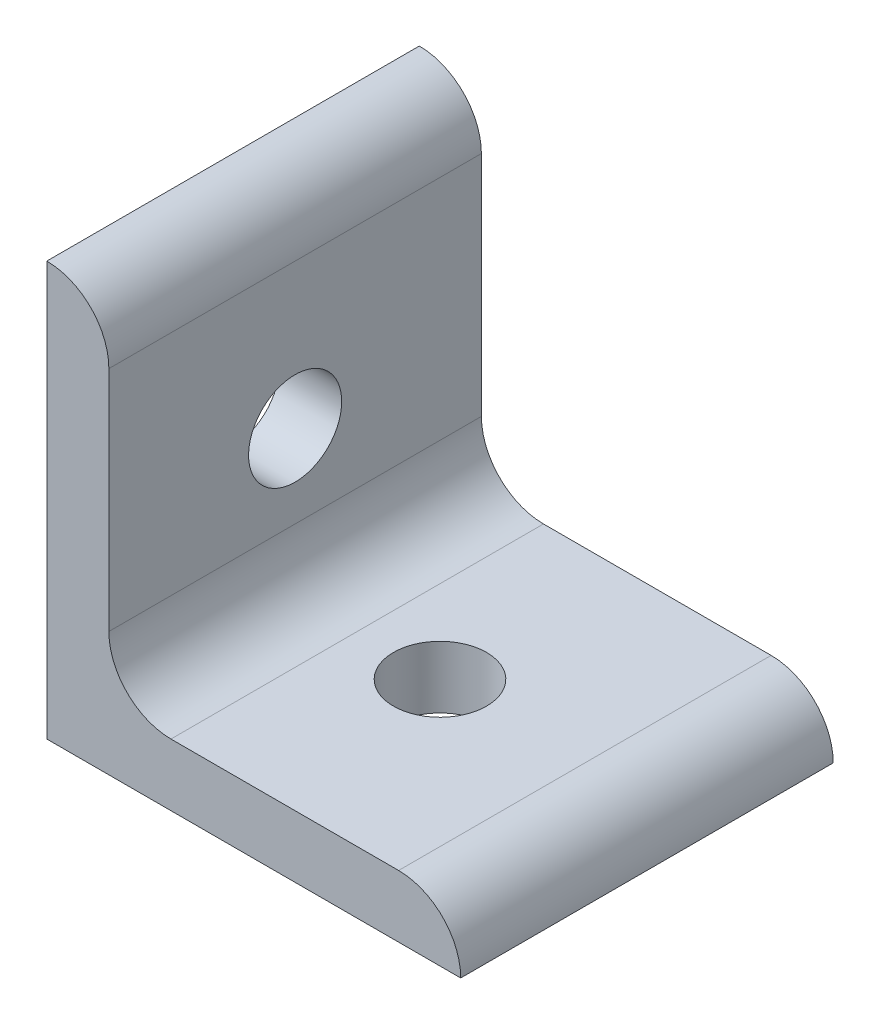
ISO-10303-21;
HEADER;
FILE_DESCRIPTION(('STEP AP214'),'2;1');
FILE_NAME('part.step','',(''),(''),'','','');
FILE_SCHEMA(('AUTOMOTIVE_DESIGN { 1 0 10303 214 1 1 1 1 }'));
ENDSEC;
DATA;
#1=APPLICATION_CONTEXT('core data for automotive mechanical design processes');
#2=APPLICATION_PROTOCOL_DEFINITION('international standard','automotive_design',2000,#1);
#3=PRODUCT_CONTEXT('',#1,'mechanical');
#4=PRODUCT('Part','Part','',(#3));
#5=PRODUCT_RELATED_PRODUCT_CATEGORY('part','',(#4));
#6=PRODUCT_DEFINITION_FORMATION('','',#4);
#7=PRODUCT_DEFINITION_CONTEXT('part definition',#1,'design');
#8=PRODUCT_DEFINITION('design','',#6,#7);
#9=PRODUCT_DEFINITION_SHAPE('','',#8);
#10=(LENGTH_UNIT() NAMED_UNIT(*) SI_UNIT(.MILLI.,.METRE.));
#11=(NAMED_UNIT(*) PLANE_ANGLE_UNIT() SI_UNIT($,.RADIAN.));
#12=(NAMED_UNIT(*) SI_UNIT($,.STERADIAN.) SOLID_ANGLE_UNIT());
#13=UNCERTAINTY_MEASURE_WITH_UNIT(LENGTH_MEASURE(1.E-05),#10,'distance_accuracy_value','');
#14=(GEOMETRIC_REPRESENTATION_CONTEXT(3) GLOBAL_UNCERTAINTY_ASSIGNED_CONTEXT((#13)) GLOBAL_UNIT_ASSIGNED_CONTEXT((#10,
#11,#12)) REPRESENTATION_CONTEXT('',''));
#15=CARTESIAN_POINT('',(0.,0.,0.));
#16=DIRECTION('',(0.,0.,1.));
#17=DIRECTION('',(1.,0.,0.));
#18=AXIS2_PLACEMENT_3D('',#15,#16,#17);
#19=CARTESIAN_POINT('',(6.,34.,18.));
#20=DIRECTION('',(-1.,0.,0.));
#21=DIRECTION('',(0.,-1.,0.));
#22=AXIS2_PLACEMENT_3D('',#19,#20,#21);
#23=PLANE('',#22);
#24=DIRECTION('',(0.,1.,0.));
#25=VECTOR('',#24,1.);
#26=CARTESIAN_POINT('',(6.,34.,-18.));
#27=LINE('',#26,#25);
#28=CARTESIAN_POINT('',(6.,12.,-18.));
#29=VERTEX_POINT('',#28);
#30=CARTESIAN_POINT('',(6.,34.,-18.));
#31=VERTEX_POINT('',#30);
#32=EDGE_CURVE('E119',#29,#31,#27,.T.);
#33=ORIENTED_EDGE('',*,*,#32,.T.);
#34=DIRECTION('',(0.,0.,-1.));
#35=VECTOR('',#34,1.);
#36=CARTESIAN_POINT('',(6.,34.,18.));
#37=LINE('',#36,#35);
#38=CARTESIAN_POINT('',(6.,34.,18.));
#39=VERTEX_POINT('',#38);
#40=EDGE_CURVE('E116',#39,#31,#37,.T.);
#41=ORIENTED_EDGE('',*,*,#40,.F.);
#42=DIRECTION('',(0.,1.,0.));
#43=VECTOR('',#42,1.);
#44=CARTESIAN_POINT('',(6.,34.,18.));
#45=LINE('',#44,#43);
#46=CARTESIAN_POINT('',(6.,12.,18.));
#47=VERTEX_POINT('',#46);
#48=EDGE_CURVE('E105',#47,#39,#45,.T.);
#49=ORIENTED_EDGE('',*,*,#48,.F.);
#50=DIRECTION('',(0.,0.,-1.));
#51=VECTOR('',#50,1.);
#52=CARTESIAN_POINT('',(6.,12.,18.));
#53=LINE('',#52,#51);
#54=EDGE_CURVE('E120',#47,#29,#53,.T.);
#55=ORIENTED_EDGE('',*,*,#54,.T.);
#56=EDGE_LOOP('',(#33,#41,#49,#55));
#57=FACE_BOUND('',#56,.T.);
#58=CARTESIAN_POINT('',(6.,20.,0.));
#59=DIRECTION('',(-1.,0.,0.));
#60=DIRECTION('',(0.,-1.,0.));
#61=AXIS2_PLACEMENT_3D('',#58,#59,#60);
#62=CIRCLE('',#61,4.5);
#63=CARTESIAN_POINT('',(6.,15.5,0.));
#64=VERTEX_POINT('',#63);
#65=EDGE_CURVE('E169',#64,#64,#62,.F.);
#66=ORIENTED_EDGE('',*,*,#65,.F.);
#67=EDGE_LOOP('',(#66));
#68=FACE_BOUND('',#67,.T.);
#69=ADVANCED_FACE('F37',(#57,#68),#23,.F.);
#70=CARTESIAN_POINT('',(0.,0.,18.));
#71=DIRECTION('',(1.,0.,0.));
#72=DIRECTION('',(0.,0.,-1.));
#73=AXIS2_PLACEMENT_3D('',#70,#71,#72);
#74=PLANE('',#73);
#75=DIRECTION('',(0.,-1.,0.));
#76=VECTOR('',#75,1.);
#77=CARTESIAN_POINT('',(0.,0.,-18.));
#78=LINE('',#77,#76);
#79=CARTESIAN_POINT('',(0.,40.,-18.));
#80=VERTEX_POINT('',#79);
#81=CARTESIAN_POINT('',(0.,0.,-18.));
#82=VERTEX_POINT('',#81);
#83=EDGE_CURVE('E87',#80,#82,#78,.T.);
#84=ORIENTED_EDGE('',*,*,#83,.T.);
#85=DIRECTION('',(0.,0.,-1.));
#86=VECTOR('',#85,1.);
#87=CARTESIAN_POINT('',(0.,0.,18.));
#88=LINE('',#87,#86);
#89=CARTESIAN_POINT('',(0.,0.,18.));
#90=VERTEX_POINT('',#89);
#91=EDGE_CURVE('E125',#90,#82,#88,.T.);
#92=ORIENTED_EDGE('',*,*,#91,.F.);
#93=DIRECTION('',(0.,-1.,0.));
#94=VECTOR('',#93,1.);
#95=CARTESIAN_POINT('',(0.,0.,18.));
#96=LINE('',#95,#94);
#97=CARTESIAN_POINT('',(0.,40.,18.));
#98=VERTEX_POINT('',#97);
#99=EDGE_CURVE('E55',#98,#90,#96,.T.);
#100=ORIENTED_EDGE('',*,*,#99,.F.);
#101=DIRECTION('',(0.,0.,-1.));
#102=VECTOR('',#101,1.);
#103=CARTESIAN_POINT('',(0.,40.,18.));
#104=LINE('',#103,#102);
#105=EDGE_CURVE('E121',#98,#80,#104,.T.);
#106=ORIENTED_EDGE('',*,*,#105,.T.);
#107=EDGE_LOOP('',(#84,#92,#100,#106));
#108=FACE_BOUND('',#107,.T.);
#109=CARTESIAN_POINT('',(0.,20.,0.));
#110=DIRECTION('',(1.,0.,0.));
#111=DIRECTION('',(0.,0.,-1.));
#112=AXIS2_PLACEMENT_3D('',#109,#110,#111);
#113=CIRCLE('',#112,4.5);
#114=CARTESIAN_POINT('',(0.,20.,-4.5));
#115=VERTEX_POINT('',#114);
#116=EDGE_CURVE('E172',#115,#115,#113,.T.);
#117=ORIENTED_EDGE('',*,*,#116,.T.);
#118=EDGE_LOOP('',(#117));
#119=FACE_BOUND('',#118,.T.);
#120=ADVANCED_FACE('F176',(#108,#119),#74,.F.);
#121=CARTESIAN_POINT('',(40.,0.,18.));
#122=DIRECTION('',(0.,1.,0.));
#123=DIRECTION('',(-1.,0.,0.));
#124=AXIS2_PLACEMENT_3D('',#121,#122,#123);
#125=PLANE('',#124);
#126=DIRECTION('',(1.,0.,0.));
#127=VECTOR('',#126,1.);
#128=CARTESIAN_POINT('',(40.,0.,-18.));
#129=LINE('',#128,#127);
#130=CARTESIAN_POINT('',(40.,0.,-18.));
#131=VERTEX_POINT('',#130);
#132=EDGE_CURVE('E129',#82,#131,#129,.T.);
#133=ORIENTED_EDGE('',*,*,#132,.T.);
#134=DIRECTION('',(0.,0.,-1.));
#135=VECTOR('',#134,1.);
#136=CARTESIAN_POINT('',(40.,0.,18.));
#137=LINE('',#136,#135);
#138=CARTESIAN_POINT('',(40.,0.,18.));
#139=VERTEX_POINT('',#138);
#140=EDGE_CURVE('E11',#139,#131,#137,.T.);
#141=ORIENTED_EDGE('',*,*,#140,.F.);
#142=DIRECTION('',(1.,0.,0.));
#143=VECTOR('',#142,1.);
#144=CARTESIAN_POINT('',(40.,0.,18.));
#145=LINE('',#144,#143);
#146=EDGE_CURVE('E141',#90,#139,#145,.T.);
#147=ORIENTED_EDGE('',*,*,#146,.F.);
#148=ORIENTED_EDGE('',*,*,#91,.T.);
#149=EDGE_LOOP('',(#133,#141,#147,#148));
#150=FACE_BOUND('',#149,.T.);
#151=CARTESIAN_POINT('',(20.,0.,0.));
#152=DIRECTION('',(0.,1.,0.));
#153=DIRECTION('',(0.,0.,1.));
#154=AXIS2_PLACEMENT_3D('',#151,#152,#153);
#155=CIRCLE('',#154,4.5);
#156=CARTESIAN_POINT('',(20.,0.,4.5));
#157=VERTEX_POINT('',#156);
#158=EDGE_CURVE('E166',#157,#157,#155,.T.);
#159=ORIENTED_EDGE('',*,*,#158,.T.);
#160=EDGE_LOOP('',(#159));
#161=FACE_BOUND('',#160,.T.);
#162=ADVANCED_FACE('F39',(#150,#161),#125,.F.);
#163=CARTESIAN_POINT('',(12.,6.,18.));
#164=DIRECTION('',(0.,-1.,0.));
#165=DIRECTION('',(0.,0.,-1.));
#166=AXIS2_PLACEMENT_3D('',#163,#164,#165);
#167=PLANE('',#166);
#168=DIRECTION('',(-1.,0.,0.));
#169=VECTOR('',#168,1.);
#170=CARTESIAN_POINT('',(12.,6.,-18.));
#171=LINE('',#170,#169);
#172=CARTESIAN_POINT('',(34.,6.,-18.));
#173=VERTEX_POINT('',#172);
#174=CARTESIAN_POINT('',(12.,6.,-18.));
#175=VERTEX_POINT('',#174);
#176=EDGE_CURVE('E134',#173,#175,#171,.T.);
#177=ORIENTED_EDGE('',*,*,#176,.T.);
#178=DIRECTION('',(0.,0.,-1.));
#179=VECTOR('',#178,1.);
#180=CARTESIAN_POINT('',(12.,6.,18.));
#181=LINE('',#180,#179);
#182=CARTESIAN_POINT('',(12.,6.,18.));
#183=VERTEX_POINT('',#182);
#184=EDGE_CURVE('E145',#183,#175,#181,.T.);
#185=ORIENTED_EDGE('',*,*,#184,.F.);
#186=DIRECTION('',(-1.,0.,0.));
#187=VECTOR('',#186,1.);
#188=CARTESIAN_POINT('',(12.,6.,18.));
#189=LINE('',#188,#187);
#190=CARTESIAN_POINT('',(34.,6.,18.));
#191=VERTEX_POINT('',#190);
#192=EDGE_CURVE('E155',#191,#183,#189,.T.);
#193=ORIENTED_EDGE('',*,*,#192,.F.);
#194=DIRECTION('',(0.,0.,-1.));
#195=VECTOR('',#194,1.);
#196=CARTESIAN_POINT('',(34.,6.,18.));
#197=LINE('',#196,#195);
#198=EDGE_CURVE('E47',#191,#173,#197,.T.);
#199=ORIENTED_EDGE('',*,*,#198,.T.);
#200=EDGE_LOOP('',(#177,#185,#193,#199));
#201=FACE_BOUND('',#200,.T.);
#202=CARTESIAN_POINT('',(20.,6.00000000000001,0.));
#203=DIRECTION('',(0.,-1.,0.));
#204=DIRECTION('',(0.,0.,-1.));
#205=AXIS2_PLACEMENT_3D('',#202,#203,#204);
#206=CIRCLE('',#205,4.5);
#207=CARTESIAN_POINT('',(20.,6.00000000000001,-4.5));
#208=VERTEX_POINT('',#207);
#209=EDGE_CURVE('E41',#208,#208,#206,.F.);
#210=ORIENTED_EDGE('',*,*,#209,.F.);
#211=EDGE_LOOP('',(#210));
#212=FACE_BOUND('',#211,.T.);
#213=ADVANCED_FACE('F152',(#201,#212),#167,.F.);
#214=CARTESIAN_POINT('',(34.,0.,18.));
#215=DIRECTION('',(0.,0.,-1.));
#216=DIRECTION('',(-1.,0.,0.));
#217=AXIS2_PLACEMENT_3D('',#214,#215,#216);
#218=CYLINDRICAL_SURFACE('',#217,6.);
#219=CARTESIAN_POINT('',(34.,0.,-18.));
#220=DIRECTION('',(0.,0.,1.));
#221=DIRECTION('',(1.,0.,0.));
#222=AXIS2_PLACEMENT_3D('',#219,#220,#221);
#223=CIRCLE('',#222,6.);
#224=EDGE_CURVE('E132',#131,#173,#223,.T.);
#225=ORIENTED_EDGE('',*,*,#224,.T.);
#226=ORIENTED_EDGE('',*,*,#198,.F.);
#227=CARTESIAN_POINT('',(34.,0.,18.));
#228=DIRECTION('',(0.,0.,1.));
#229=DIRECTION('',(1.,0.,0.));
#230=AXIS2_PLACEMENT_3D('',#227,#228,#229);
#231=CIRCLE('',#230,6.);
#232=EDGE_CURVE('E95',#139,#191,#231,.T.);
#233=ORIENTED_EDGE('',*,*,#232,.F.);
#234=ORIENTED_EDGE('',*,*,#140,.T.);
#235=EDGE_LOOP('',(#225,#226,#233,#234));
#236=FACE_BOUND('',#235,.T.);
#237=ADVANCED_FACE('F195',(#236),#218,.T.);
#238=CARTESIAN_POINT('',(12.,12.,18.));
#239=DIRECTION('',(0.,0.,-1.));
#240=DIRECTION('',(-1.,0.,0.));
#241=AXIS2_PLACEMENT_3D('',#238,#239,#240);
#242=CYLINDRICAL_SURFACE('',#241,6.);
#243=CARTESIAN_POINT('',(12.,12.,-18.));
#244=DIRECTION('',(0.,0.,-1.));
#245=DIRECTION('',(1.,0.,0.));
#246=AXIS2_PLACEMENT_3D('',#243,#244,#245);
#247=CIRCLE('',#246,6.);
#248=EDGE_CURVE('E136',#175,#29,#247,.T.);
#249=ORIENTED_EDGE('',*,*,#248,.T.);
#250=ORIENTED_EDGE('',*,*,#54,.F.);
#251=CARTESIAN_POINT('',(12.,12.,18.));
#252=DIRECTION('',(0.,0.,-1.));
#253=DIRECTION('',(1.,0.,0.));
#254=AXIS2_PLACEMENT_3D('',#251,#252,#253);
#255=CIRCLE('',#254,6.);
#256=EDGE_CURVE('E111',#183,#47,#255,.T.);
#257=ORIENTED_EDGE('',*,*,#256,.F.);
#258=ORIENTED_EDGE('',*,*,#184,.T.);
#259=EDGE_LOOP('',(#249,#250,#257,#258));
#260=FACE_BOUND('',#259,.T.);
#261=ADVANCED_FACE('F161',(#260),#242,.F.);
#262=CARTESIAN_POINT('',(0.,34.,18.));
#263=DIRECTION('',(0.,0.,-1.));
#264=DIRECTION('',(-1.,0.,0.));
#265=AXIS2_PLACEMENT_3D('',#262,#263,#264);
#266=CYLINDRICAL_SURFACE('',#265,6.);
#267=CARTESIAN_POINT('',(0.,34.,-18.));
#268=DIRECTION('',(0.,0.,1.));
#269=DIRECTION('',(1.,0.,0.));
#270=AXIS2_PLACEMENT_3D('',#267,#268,#269);
#271=CIRCLE('',#270,6.);
#272=EDGE_CURVE('E81',#31,#80,#271,.T.);
#273=ORIENTED_EDGE('',*,*,#272,.T.);
#274=ORIENTED_EDGE('',*,*,#105,.F.);
#275=CARTESIAN_POINT('',(0.,34.,18.));
#276=DIRECTION('',(0.,0.,1.));
#277=DIRECTION('',(1.,0.,0.));
#278=AXIS2_PLACEMENT_3D('',#275,#276,#277);
#279=CIRCLE('',#278,6.);
#280=EDGE_CURVE('E109',#39,#98,#279,.T.);
#281=ORIENTED_EDGE('',*,*,#280,.F.);
#282=ORIENTED_EDGE('',*,*,#40,.T.);
#283=EDGE_LOOP('',(#273,#274,#281,#282));
#284=FACE_BOUND('',#283,.T.);
#285=ADVANCED_FACE('F123',(#284),#266,.T.);
#286=CARTESIAN_POINT('',(0.,34.,18.));
#287=DIRECTION('',(0.,0.,1.));
#288=DIRECTION('',(1.,0.,0.));
#289=AXIS2_PLACEMENT_3D('',#286,#287,#288);
#290=PLANE('',#289);
#291=ORIENTED_EDGE('',*,*,#146,.T.);
#292=ORIENTED_EDGE('',*,*,#232,.T.);
#293=ORIENTED_EDGE('',*,*,#192,.T.);
#294=ORIENTED_EDGE('',*,*,#256,.T.);
#295=ORIENTED_EDGE('',*,*,#48,.T.);
#296=ORIENTED_EDGE('',*,*,#280,.T.);
#297=ORIENTED_EDGE('',*,*,#99,.T.);
#298=EDGE_LOOP('',(#291,#292,#293,#294,#295,#296,#297));
#299=FACE_BOUND('',#298,.T.);
#300=ADVANCED_FACE('F107',(#299),#290,.T.);
#301=CARTESIAN_POINT('',(0.,34.,-18.));
#302=DIRECTION('',(0.,0.,1.));
#303=DIRECTION('',(1.,0.,0.));
#304=AXIS2_PLACEMENT_3D('',#301,#302,#303);
#305=PLANE('',#304);
#306=ORIENTED_EDGE('',*,*,#132,.F.);
#307=ORIENTED_EDGE('',*,*,#83,.F.);
#308=ORIENTED_EDGE('',*,*,#272,.F.);
#309=ORIENTED_EDGE('',*,*,#32,.F.);
#310=ORIENTED_EDGE('',*,*,#248,.F.);
#311=ORIENTED_EDGE('',*,*,#176,.F.);
#312=ORIENTED_EDGE('',*,*,#224,.F.);
#313=EDGE_LOOP('',(#306,#307,#308,#309,#310,#311,#312));
#314=FACE_BOUND('',#313,.T.);
#315=ADVANCED_FACE('F159',(#314),#305,.F.);
#316=CARTESIAN_POINT('',(20.,40.,0.));
#317=DIRECTION('',(0.,-1.,0.));
#318=DIRECTION('',(0.,0.,-1.));
#319=AXIS2_PLACEMENT_3D('',#316,#317,#318);
#320=CYLINDRICAL_SURFACE('',#319,4.5);
#321=ORIENTED_EDGE('',*,*,#158,.F.);
#322=EDGE_LOOP('',(#321));
#323=FACE_BOUND('',#322,.T.);
#324=ORIENTED_EDGE('',*,*,#209,.T.);
#325=EDGE_LOOP('',(#324));
#326=FACE_BOUND('',#325,.T.);
#327=ADVANCED_FACE('F181',(#323,#326),#320,.F.);
#328=CARTESIAN_POINT('',(40.,20.,0.));
#329=DIRECTION('',(-1.,0.,0.));
#330=DIRECTION('',(0.,0.,1.));
#331=AXIS2_PLACEMENT_3D('',#328,#329,#330);
#332=CYLINDRICAL_SURFACE('',#331,4.5);
#333=ORIENTED_EDGE('',*,*,#116,.F.);
#334=EDGE_LOOP('',(#333));
#335=FACE_BOUND('',#334,.T.);
#336=ORIENTED_EDGE('',*,*,#65,.T.);
#337=EDGE_LOOP('',(#336));
#338=FACE_BOUND('',#337,.T.);
#339=ADVANCED_FACE('F178',(#335,#338),#332,.F.);
#340=CLOSED_SHELL('',(#69,#120,#162,#213,#237,#261,#285,#300,#315,#327,#339));
#341=MANIFOLD_SOLID_BREP('B2',#340);
#342=ADVANCED_BREP_SHAPE_REPRESENTATION('',(#18,#341),#14);
#343=SHAPE_DEFINITION_REPRESENTATION(#9,#342);
ENDSEC;
END-ISO-10303-21;
